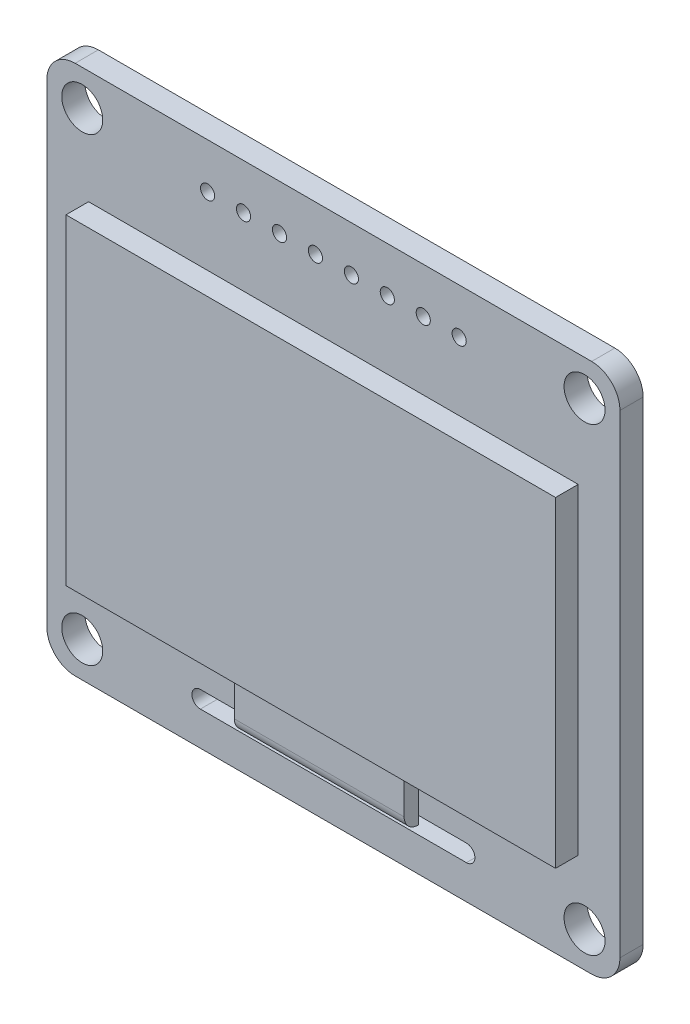
ISO-10303-21;
HEADER;
FILE_DESCRIPTION(('STEP AP214'),'2;1');
FILE_NAME('part.step','',(''),(''),'','','');
FILE_SCHEMA(('AUTOMOTIVE_DESIGN { 1 0 10303 214 1 1 1 1 }'));
ENDSEC;
DATA;
#1=APPLICATION_CONTEXT('core data for automotive mechanical design processes');
#2=APPLICATION_PROTOCOL_DEFINITION('international standard','automotive_design',2000,#1);
#3=PRODUCT_CONTEXT('',#1,'mechanical');
#4=PRODUCT('Part','Part','',(#3));
#5=PRODUCT_RELATED_PRODUCT_CATEGORY('part','',(#4));
#6=PRODUCT_DEFINITION_FORMATION('','',#4);
#7=PRODUCT_DEFINITION_CONTEXT('part definition',#1,'design');
#8=PRODUCT_DEFINITION('design','',#6,#7);
#9=PRODUCT_DEFINITION_SHAPE('','',#8);
#10=(LENGTH_UNIT() NAMED_UNIT(*) SI_UNIT(.MILLI.,.METRE.));
#11=(NAMED_UNIT(*) PLANE_ANGLE_UNIT() SI_UNIT($,.RADIAN.));
#12=(NAMED_UNIT(*) SI_UNIT($,.STERADIAN.) SOLID_ANGLE_UNIT());
#13=UNCERTAINTY_MEASURE_WITH_UNIT(LENGTH_MEASURE(1.E-05),#10,'distance_accuracy_value','');
#14=(GEOMETRIC_REPRESENTATION_CONTEXT(3) GLOBAL_UNCERTAINTY_ASSIGNED_CONTEXT((#13)) GLOBAL_UNIT_ASSIGNED_CONTEXT((#10,
#11,#12)) REPRESENTATION_CONTEXT('',''));
#15=CARTESIAN_POINT('',(0.,0.,0.));
#16=DIRECTION('',(0.,0.,1.));
#17=DIRECTION('',(1.,0.,0.));
#18=AXIS2_PLACEMENT_3D('',#15,#16,#17);
#19=CARTESIAN_POINT('',(0.,0.,1.64));
#20=DIRECTION('',(0.,0.,1.));
#21=DIRECTION('',(1.,0.,0.));
#22=AXIS2_PLACEMENT_3D('',#19,#20,#21);
#23=PLANE('',#22);
#24=CARTESIAN_POINT('',(-6.35,15.55,1.64));
#25=DIRECTION('',(0.,0.,1.));
#26=DIRECTION('',(1.,0.,0.));
#27=AXIS2_PLACEMENT_3D('',#24,#25,#26);
#28=CIRCLE('',#27,0.500000000000001);
#29=CARTESIAN_POINT('',(-5.85,15.55,1.64));
#30=VERTEX_POINT('',#29);
#31=EDGE_CURVE('E233',#30,#30,#28,.T.);
#32=ORIENTED_EDGE('',*,*,#31,.F.);
#33=EDGE_LOOP('',(#32));
#34=FACE_BOUND('',#33,.T.);
#35=CARTESIAN_POINT('',(-3.81,15.55,1.64));
#36=DIRECTION('',(0.,0.,1.));
#37=DIRECTION('',(1.,0.,0.));
#38=AXIS2_PLACEMENT_3D('',#35,#36,#37);
#39=CIRCLE('',#38,0.5);
#40=CARTESIAN_POINT('',(-3.31,15.55,1.64));
#41=VERTEX_POINT('',#40);
#42=EDGE_CURVE('E241',#41,#41,#39,.T.);
#43=ORIENTED_EDGE('',*,*,#42,.F.);
#44=EDGE_LOOP('',(#43));
#45=FACE_BOUND('',#44,.T.);
#46=CARTESIAN_POINT('',(-1.27,15.55,1.64));
#47=DIRECTION('',(0.,0.,1.));
#48=DIRECTION('',(1.,0.,0.));
#49=AXIS2_PLACEMENT_3D('',#46,#47,#48);
#50=CIRCLE('',#49,0.5);
#51=CARTESIAN_POINT('',(-0.77,15.55,1.64));
#52=VERTEX_POINT('',#51);
#53=EDGE_CURVE('E247',#52,#52,#50,.T.);
#54=ORIENTED_EDGE('',*,*,#53,.F.);
#55=EDGE_LOOP('',(#54));
#56=FACE_BOUND('',#55,.T.);
#57=CARTESIAN_POINT('',(1.27,15.55,1.64));
#58=DIRECTION('',(0.,0.,1.));
#59=DIRECTION('',(1.,0.,0.));
#60=AXIS2_PLACEMENT_3D('',#57,#58,#59);
#61=CIRCLE('',#60,0.500000000000001);
#62=CARTESIAN_POINT('',(1.77,15.55,1.64));
#63=VERTEX_POINT('',#62);
#64=EDGE_CURVE('E253',#63,#63,#61,.T.);
#65=ORIENTED_EDGE('',*,*,#64,.F.);
#66=EDGE_LOOP('',(#65));
#67=FACE_BOUND('',#66,.T.);
#68=CARTESIAN_POINT('',(3.81,15.55,1.64));
#69=DIRECTION('',(0.,0.,1.));
#70=DIRECTION('',(1.,0.,0.));
#71=AXIS2_PLACEMENT_3D('',#68,#69,#70);
#72=CIRCLE('',#71,0.500000000000001);
#73=CARTESIAN_POINT('',(4.31,15.55,1.64));
#74=VERTEX_POINT('',#73);
#75=EDGE_CURVE('E259',#74,#74,#72,.T.);
#76=ORIENTED_EDGE('',*,*,#75,.F.);
#77=EDGE_LOOP('',(#76));
#78=FACE_BOUND('',#77,.T.);
#79=CARTESIAN_POINT('',(6.35,15.55,1.64));
#80=DIRECTION('',(0.,0.,1.));
#81=DIRECTION('',(1.,0.,0.));
#82=AXIS2_PLACEMENT_3D('',#79,#80,#81);
#83=CIRCLE('',#82,0.500000000000001);
#84=CARTESIAN_POINT('',(6.85,15.55,1.64));
#85=VERTEX_POINT('',#84);
#86=EDGE_CURVE('E265',#85,#85,#83,.T.);
#87=ORIENTED_EDGE('',*,*,#86,.F.);
#88=EDGE_LOOP('',(#87));
#89=FACE_BOUND('',#88,.T.);
#90=CARTESIAN_POINT('',(8.89,15.55,1.64));
#91=DIRECTION('',(0.,0.,1.));
#92=DIRECTION('',(1.,0.,0.));
#93=AXIS2_PLACEMENT_3D('',#90,#91,#92);
#94=CIRCLE('',#93,0.499999999999999);
#95=CARTESIAN_POINT('',(9.39,15.55,1.64));
#96=VERTEX_POINT('',#95);
#97=EDGE_CURVE('E232',#96,#96,#94,.T.);
#98=ORIENTED_EDGE('',*,*,#97,.F.);
#99=EDGE_LOOP('',(#98));
#100=FACE_BOUND('',#99,.T.);
#101=CARTESIAN_POINT('',(-8.89,15.55,1.64));
#102=DIRECTION('',(0.,0.,1.));
#103=DIRECTION('',(1.,0.,0.));
#104=AXIS2_PLACEMENT_3D('',#101,#102,#103);
#105=CIRCLE('',#104,0.500000000000001);
#106=CARTESIAN_POINT('',(-8.39,15.55,1.64));
#107=VERTEX_POINT('',#106);
#108=EDGE_CURVE('E240',#107,#107,#105,.T.);
#109=ORIENTED_EDGE('',*,*,#108,.F.);
#110=EDGE_LOOP('',(#109));
#111=FACE_BOUND('',#110,.T.);
#112=CARTESIAN_POINT('',(17.75,16.25,1.64));
#113=DIRECTION('',(0.,0.,1.));
#114=DIRECTION('',(1.,0.,0.));
#115=AXIS2_PLACEMENT_3D('',#112,#113,#114);
#116=CIRCLE('',#115,1.45);
#117=CARTESIAN_POINT('',(19.2,16.25,1.64));
#118=VERTEX_POINT('',#117);
#119=EDGE_CURVE('E314',#118,#118,#116,.T.);
#120=ORIENTED_EDGE('',*,*,#119,.F.);
#121=EDGE_LOOP('',(#120));
#122=FACE_BOUND('',#121,.T.);
#123=CARTESIAN_POINT('',(17.7500000000003,-16.25,1.64));
#124=DIRECTION('',(0.,0.,1.));
#125=DIRECTION('',(1.,0.,0.));
#126=AXIS2_PLACEMENT_3D('',#123,#124,#125);
#127=CIRCLE('',#126,1.45);
#128=CARTESIAN_POINT('',(19.2000000000003,-16.25,1.64));
#129=VERTEX_POINT('',#128);
#130=EDGE_CURVE('E322',#129,#129,#127,.T.);
#131=ORIENTED_EDGE('',*,*,#130,.F.);
#132=EDGE_LOOP('',(#131));
#133=FACE_BOUND('',#132,.T.);
#134=CARTESIAN_POINT('',(-17.7499999999997,-16.25,1.64));
#135=DIRECTION('',(0.,0.,1.));
#136=DIRECTION('',(1.,0.,0.));
#137=AXIS2_PLACEMENT_3D('',#134,#135,#136);
#138=CIRCLE('',#137,1.45);
#139=CARTESIAN_POINT('',(-16.2999999999997,-16.25,1.64));
#140=VERTEX_POINT('',#139);
#141=EDGE_CURVE('E313',#140,#140,#138,.T.);
#142=ORIENTED_EDGE('',*,*,#141,.F.);
#143=EDGE_LOOP('',(#142));
#144=FACE_BOUND('',#143,.T.);
#145=CARTESIAN_POINT('',(-17.75,16.25,1.64));
#146=DIRECTION('',(0.,0.,1.));
#147=DIRECTION('',(1.,0.,0.));
#148=AXIS2_PLACEMENT_3D('',#145,#146,#147);
#149=CIRCLE('',#148,1.45);
#150=CARTESIAN_POINT('',(-16.3,16.25,1.64));
#151=VERTEX_POINT('',#150);
#152=EDGE_CURVE('E321',#151,#151,#149,.T.);
#153=ORIENTED_EDGE('',*,*,#152,.F.);
#154=EDGE_LOOP('',(#153));
#155=FACE_BOUND('',#154,.T.);
#156=DIRECTION('',(0.,-1.,0.));
#157=VECTOR('',#156,1.);
#158=CARTESIAN_POINT('',(-20.25,18.75,1.64));
#159=LINE('',#158,#157);
#160=CARTESIAN_POINT('',(-20.25,16.75,1.64));
#161=VERTEX_POINT('',#160);
#162=CARTESIAN_POINT('',(-20.25,-16.75,1.64));
#163=VERTEX_POINT('',#162);
#164=EDGE_CURVE('E338',#161,#163,#159,.T.);
#165=ORIENTED_EDGE('',*,*,#164,.T.);
#166=CARTESIAN_POINT('',(-18.25,-16.75,1.64));
#167=DIRECTION('',(0.,0.,1.));
#168=DIRECTION('',(1.,0.,0.));
#169=AXIS2_PLACEMENT_3D('',#166,#167,#168);
#170=CIRCLE('',#169,2.);
#171=CARTESIAN_POINT('',(-18.25,-18.75,1.64));
#172=VERTEX_POINT('',#171);
#173=EDGE_CURVE('E385',#163,#172,#170,.T.);
#174=ORIENTED_EDGE('',*,*,#173,.T.);
#175=DIRECTION('',(1.,0.,0.));
#176=VECTOR('',#175,1.);
#177=CARTESIAN_POINT('',(-20.25,-18.75,1.64));
#178=LINE('',#177,#176);
#179=CARTESIAN_POINT('',(18.25,-18.75,1.64));
#180=VERTEX_POINT('',#179);
#181=EDGE_CURVE('E341',#172,#180,#178,.T.);
#182=ORIENTED_EDGE('',*,*,#181,.T.);
#183=CARTESIAN_POINT('',(18.25,-16.75,1.64));
#184=DIRECTION('',(0.,0.,1.));
#185=DIRECTION('',(1.,0.,0.));
#186=AXIS2_PLACEMENT_3D('',#183,#184,#185);
#187=CIRCLE('',#186,2.);
#188=CARTESIAN_POINT('',(20.25,-16.75,1.64));
#189=VERTEX_POINT('',#188);
#190=EDGE_CURVE('E383',#180,#189,#187,.T.);
#191=ORIENTED_EDGE('',*,*,#190,.T.);
#192=DIRECTION('',(0.,1.,0.));
#193=VECTOR('',#192,1.);
#194=CARTESIAN_POINT('',(20.25,18.75,1.64));
#195=LINE('',#194,#193);
#196=CARTESIAN_POINT('',(20.25,16.75,1.64));
#197=VERTEX_POINT('',#196);
#198=EDGE_CURVE('E345',#189,#197,#195,.T.);
#199=ORIENTED_EDGE('',*,*,#198,.T.);
#200=CARTESIAN_POINT('',(18.25,16.75,1.64));
#201=DIRECTION('',(0.,0.,1.));
#202=DIRECTION('',(1.,0.,0.));
#203=AXIS2_PLACEMENT_3D('',#200,#201,#202);
#204=CIRCLE('',#203,2.);
#205=CARTESIAN_POINT('',(18.25,18.75,1.64));
#206=VERTEX_POINT('',#205);
#207=EDGE_CURVE('E381',#197,#206,#204,.T.);
#208=ORIENTED_EDGE('',*,*,#207,.T.);
#209=DIRECTION('',(-1.,0.,0.));
#210=VECTOR('',#209,1.);
#211=CARTESIAN_POINT('',(-20.25,18.75,1.64));
#212=LINE('',#211,#210);
#213=CARTESIAN_POINT('',(-18.25,18.75,1.64));
#214=VERTEX_POINT('',#213);
#215=EDGE_CURVE('E348',#206,#214,#212,.T.);
#216=ORIENTED_EDGE('',*,*,#215,.T.);
#217=CARTESIAN_POINT('',(-18.25,16.75,1.64));
#218=DIRECTION('',(0.,0.,1.));
#219=DIRECTION('',(1.,0.,0.));
#220=AXIS2_PLACEMENT_3D('',#217,#218,#219);
#221=CIRCLE('',#220,2.);
#222=EDGE_CURVE('E379',#214,#161,#221,.T.);
#223=ORIENTED_EDGE('',*,*,#222,.T.);
#224=EDGE_LOOP('',(#165,#174,#182,#191,#199,#208,#216,#223));
#225=FACE_BOUND('',#224,.T.);
#226=DIRECTION('',(-1.,0.,0.));
#227=VECTOR('',#226,1.);
#228=CARTESIAN_POINT('',(-9.4,-15.15,1.64));
#229=LINE('',#228,#227);
#230=CARTESIAN_POINT('',(-6.,-15.15,1.64));
#231=VERTEX_POINT('',#230);
#232=CARTESIAN_POINT('',(-9.4,-15.15,1.64));
#233=VERTEX_POINT('',#232);
#234=EDGE_CURVE('E296',#231,#233,#229,.T.);
#235=ORIENTED_EDGE('',*,*,#234,.F.);
#236=DIRECTION('',(0.,-1.,0.));
#237=VECTOR('',#236,1.);
#238=CARTESIAN_POINT('',(-6.,-11.95,1.64));
#239=LINE('',#238,#237);
#240=CARTESIAN_POINT('',(-6.,-11.95,1.64));
#241=VERTEX_POINT('',#240);
#242=EDGE_CURVE('E409',#241,#231,#239,.T.);
#243=ORIENTED_EDGE('',*,*,#242,.F.);
#244=DIRECTION('',(1.,0.,0.));
#245=VECTOR('',#244,1.);
#246=CARTESIAN_POINT('',(-17.3,-11.95,1.64));
#247=LINE('',#246,#245);
#248=CARTESIAN_POINT('',(-17.3,-11.95,1.64));
#249=VERTEX_POINT('',#248);
#250=EDGE_CURVE('E194',#249,#241,#247,.T.);
#251=ORIENTED_EDGE('',*,*,#250,.F.);
#252=DIRECTION('',(0.,-1.,0.));
#253=VECTOR('',#252,1.);
#254=CARTESIAN_POINT('',(-17.3,10.75,1.64));
#255=LINE('',#254,#253);
#256=CARTESIAN_POINT('',(-17.3,10.75,1.64));
#257=VERTEX_POINT('',#256);
#258=EDGE_CURVE('E203',#257,#249,#255,.T.);
#259=ORIENTED_EDGE('',*,*,#258,.F.);
#260=DIRECTION('',(-1.,0.,0.));
#261=VECTOR('',#260,1.);
#262=CARTESIAN_POINT('',(-17.3,10.75,1.64));
#263=LINE('',#262,#261);
#264=CARTESIAN_POINT('',(17.3,10.75,1.64));
#265=VERTEX_POINT('',#264);
#266=EDGE_CURVE('E208',#265,#257,#263,.T.);
#267=ORIENTED_EDGE('',*,*,#266,.F.);
#268=DIRECTION('',(0.,1.,0.));
#269=VECTOR('',#268,1.);
#270=CARTESIAN_POINT('',(17.3,10.75,1.64));
#271=LINE('',#270,#269);
#272=CARTESIAN_POINT('',(17.3,-11.95,1.64));
#273=VERTEX_POINT('',#272);
#274=EDGE_CURVE('E219',#273,#265,#271,.T.);
#275=ORIENTED_EDGE('',*,*,#274,.F.);
#276=CARTESIAN_POINT('',(6.,-11.95,1.64));
#277=VERTEX_POINT('',#276);
#278=EDGE_CURVE('E217',#277,#273,#247,.T.);
#279=ORIENTED_EDGE('',*,*,#278,.F.);
#280=DIRECTION('',(0.,1.,0.));
#281=VECTOR('',#280,1.);
#282=CARTESIAN_POINT('',(6.,-11.95,1.64));
#283=LINE('',#282,#281);
#284=CARTESIAN_POINT('',(6.,-15.15,1.64));
#285=VERTEX_POINT('',#284);
#286=EDGE_CURVE('E408',#285,#277,#283,.T.);
#287=ORIENTED_EDGE('',*,*,#286,.F.);
#288=CARTESIAN_POINT('',(9.4,-15.15,1.64));
#289=VERTEX_POINT('',#288);
#290=EDGE_CURVE('E297',#289,#285,#229,.T.);
#291=ORIENTED_EDGE('',*,*,#290,.F.);
#292=CARTESIAN_POINT('',(9.4,-15.75,1.64));
#293=DIRECTION('',(0.,0.,1.));
#294=DIRECTION('',(1.,0.,0.));
#295=AXIS2_PLACEMENT_3D('',#292,#293,#294);
#296=CIRCLE('',#295,0.599999999999999);
#297=CARTESIAN_POINT('',(9.4,-16.35,1.64));
#298=VERTEX_POINT('',#297);
#299=EDGE_CURVE('E293',#298,#289,#296,.T.);
#300=ORIENTED_EDGE('',*,*,#299,.F.);
#301=DIRECTION('',(1.,0.,0.));
#302=VECTOR('',#301,1.);
#303=CARTESIAN_POINT('',(-9.4,-16.35,1.64));
#304=LINE('',#303,#302);
#305=CARTESIAN_POINT('',(-9.4,-16.35,1.64));
#306=VERTEX_POINT('',#305);
#307=EDGE_CURVE('E290',#306,#298,#304,.T.);
#308=ORIENTED_EDGE('',*,*,#307,.F.);
#309=CARTESIAN_POINT('',(-9.4,-15.75,1.64));
#310=DIRECTION('',(0.,0.,1.));
#311=DIRECTION('',(1.,0.,0.));
#312=AXIS2_PLACEMENT_3D('',#309,#310,#311);
#313=CIRCLE('',#312,0.6);
#314=EDGE_CURVE('E288',#233,#306,#313,.T.);
#315=ORIENTED_EDGE('',*,*,#314,.F.);
#316=EDGE_LOOP('',(#235,#243,#251,#259,#267,#275,#279,#287,#291,#300,#308,#315));
#317=FACE_BOUND('',#316,.T.);
#318=ADVANCED_FACE('F34',(#34,#45,#56,#67,#78,#89,#100,#111,#122,#133,#144,#155,#225,#317),#23,.T.);
#319=CARTESIAN_POINT('',(-17.3,-11.95,3.24));
#320=DIRECTION('',(0.,1.,0.));
#321=DIRECTION('',(0.,0.,1.));
#322=AXIS2_PLACEMENT_3D('',#319,#320,#321);
#323=PLANE('',#322);
#324=DIRECTION('',(0.,0.,-1.));
#325=VECTOR('',#324,1.);
#326=CARTESIAN_POINT('',(-6.,-11.95,2.64));
#327=LINE('',#326,#325);
#328=CARTESIAN_POINT('',(-6.,-11.95,2.64));
#329=VERTEX_POINT('',#328);
#330=EDGE_CURVE('E184',#329,#241,#327,.T.);
#331=ORIENTED_EDGE('',*,*,#330,.F.);
#332=DIRECTION('',(-1.,0.,0.));
#333=VECTOR('',#332,1.);
#334=CARTESIAN_POINT('',(-6.,-11.95,2.64));
#335=LINE('',#334,#333);
#336=CARTESIAN_POINT('',(6.,-11.95,2.64));
#337=VERTEX_POINT('',#336);
#338=EDGE_CURVE('E175',#337,#329,#335,.T.);
#339=ORIENTED_EDGE('',*,*,#338,.F.);
#340=DIRECTION('',(0.,0.,-1.));
#341=VECTOR('',#340,1.);
#342=CARTESIAN_POINT('',(6.,-11.95,2.64));
#343=LINE('',#342,#341);
#344=EDGE_CURVE('E195',#337,#277,#343,.T.);
#345=ORIENTED_EDGE('',*,*,#344,.T.);
#346=ORIENTED_EDGE('',*,*,#278,.T.);
#347=DIRECTION('',(0.,0.,-1.));
#348=VECTOR('',#347,1.);
#349=CARTESIAN_POINT('',(17.3,-11.95,3.24));
#350=LINE('',#349,#348);
#351=CARTESIAN_POINT('',(17.3,-11.95,3.24));
#352=VERTEX_POINT('',#351);
#353=EDGE_CURVE('E227',#352,#273,#350,.T.);
#354=ORIENTED_EDGE('',*,*,#353,.F.);
#355=DIRECTION('',(1.,0.,0.));
#356=VECTOR('',#355,1.);
#357=CARTESIAN_POINT('',(-17.3,-11.95,3.24));
#358=LINE('',#357,#356);
#359=CARTESIAN_POINT('',(-17.3,-11.95,3.24));
#360=VERTEX_POINT('',#359);
#361=EDGE_CURVE('E207',#360,#352,#358,.T.);
#362=ORIENTED_EDGE('',*,*,#361,.F.);
#363=DIRECTION('',(0.,0.,-1.));
#364=VECTOR('',#363,1.);
#365=CARTESIAN_POINT('',(-17.3,-11.95,3.24));
#366=LINE('',#365,#364);
#367=EDGE_CURVE('E230',#360,#249,#366,.T.);
#368=ORIENTED_EDGE('',*,*,#367,.T.);
#369=ORIENTED_EDGE('',*,*,#250,.T.);
#370=EDGE_LOOP('',(#331,#339,#345,#346,#354,#362,#368,#369));
#371=FACE_BOUND('',#370,.T.);
#372=ADVANCED_FACE('F192',(#371),#323,.F.);
#373=CARTESIAN_POINT('',(-20.25,18.75,1.64));
#374=DIRECTION('',(1.,0.,0.));
#375=DIRECTION('',(0.,1.,0.));
#376=AXIS2_PLACEMENT_3D('',#373,#374,#375);
#377=PLANE('',#376);
#378=DIRECTION('',(0.,-1.,0.));
#379=VECTOR('',#378,1.);
#380=CARTESIAN_POINT('',(-20.25,18.75,0.));
#381=LINE('',#380,#379);
#382=CARTESIAN_POINT('',(-20.25,16.75,0.));
#383=VERTEX_POINT('',#382);
#384=CARTESIAN_POINT('',(-20.25,-16.75,0.));
#385=VERTEX_POINT('',#384);
#386=EDGE_CURVE('E337',#383,#385,#381,.T.);
#387=ORIENTED_EDGE('',*,*,#386,.T.);
#388=DIRECTION('',(0.,0.,-1.));
#389=VECTOR('',#388,1.);
#390=CARTESIAN_POINT('',(-20.25,-16.75,1.64));
#391=LINE('',#390,#389);
#392=EDGE_CURVE('E377',#385,#163,#391,.F.);
#393=ORIENTED_EDGE('',*,*,#392,.T.);
#394=ORIENTED_EDGE('',*,*,#164,.F.);
#395=DIRECTION('',(0.,0.,-1.));
#396=VECTOR('',#395,1.);
#397=CARTESIAN_POINT('',(-20.25,16.75,1.64));
#398=LINE('',#397,#396);
#399=EDGE_CURVE('E374',#161,#383,#398,.T.);
#400=ORIENTED_EDGE('',*,*,#399,.T.);
#401=EDGE_LOOP('',(#387,#393,#394,#400));
#402=FACE_BOUND('',#401,.T.);
#403=ADVANCED_FACE('F455',(#402),#377,.F.);
#404=CARTESIAN_POINT('',(-20.25,-18.75,1.64));
#405=DIRECTION('',(0.,1.,0.));
#406=DIRECTION('',(0.,0.,1.));
#407=AXIS2_PLACEMENT_3D('',#404,#405,#406);
#408=PLANE('',#407);
#409=ORIENTED_EDGE('',*,*,#181,.F.);
#410=DIRECTION('',(0.,0.,-1.));
#411=VECTOR('',#410,1.);
#412=CARTESIAN_POINT('',(-18.25,-18.75,1.64));
#413=LINE('',#412,#411);
#414=CARTESIAN_POINT('',(-18.25,-18.75,0.));
#415=VERTEX_POINT('',#414);
#416=EDGE_CURVE('E363',#172,#415,#413,.T.);
#417=ORIENTED_EDGE('',*,*,#416,.T.);
#418=DIRECTION('',(1.,0.,0.));
#419=VECTOR('',#418,1.);
#420=CARTESIAN_POINT('',(-20.25,-18.75,0.));
#421=LINE('',#420,#419);
#422=CARTESIAN_POINT('',(18.25,-18.75,0.));
#423=VERTEX_POINT('',#422);
#424=EDGE_CURVE('E354',#415,#423,#421,.T.);
#425=ORIENTED_EDGE('',*,*,#424,.T.);
#426=DIRECTION('',(0.,0.,-1.));
#427=VECTOR('',#426,1.);
#428=CARTESIAN_POINT('',(18.25,-18.75,1.64));
#429=LINE('',#428,#427);
#430=EDGE_CURVE('E351',#423,#180,#429,.F.);
#431=ORIENTED_EDGE('',*,*,#430,.T.);
#432=EDGE_LOOP('',(#409,#417,#425,#431));
#433=FACE_BOUND('',#432,.T.);
#434=ADVANCED_FACE('F475',(#433),#408,.F.);
#435=CARTESIAN_POINT('',(20.25,18.75,1.64));
#436=DIRECTION('',(-1.,0.,0.));
#437=DIRECTION('',(0.,-1.,0.));
#438=AXIS2_PLACEMENT_3D('',#435,#436,#437);
#439=PLANE('',#438);
#440=ORIENTED_EDGE('',*,*,#198,.F.);
#441=DIRECTION('',(0.,0.,-1.));
#442=VECTOR('',#441,1.);
#443=CARTESIAN_POINT('',(20.25,-16.75,1.64));
#444=LINE('',#443,#442);
#445=CARTESIAN_POINT('',(20.25,-16.75,0.));
#446=VERTEX_POINT('',#445);
#447=EDGE_CURVE('E389',#189,#446,#444,.T.);
#448=ORIENTED_EDGE('',*,*,#447,.T.);
#449=DIRECTION('',(0.,1.,0.));
#450=VECTOR('',#449,1.);
#451=CARTESIAN_POINT('',(20.25,18.75,0.));
#452=LINE('',#451,#450);
#453=CARTESIAN_POINT('',(20.25,16.75,0.));
#454=VERTEX_POINT('',#453);
#455=EDGE_CURVE('E357',#446,#454,#452,.T.);
#456=ORIENTED_EDGE('',*,*,#455,.T.);
#457=DIRECTION('',(0.,0.,-1.));
#458=VECTOR('',#457,1.);
#459=CARTESIAN_POINT('',(20.25,16.75,1.64));
#460=LINE('',#459,#458);
#461=EDGE_CURVE('E387',#454,#197,#460,.F.);
#462=ORIENTED_EDGE('',*,*,#461,.T.);
#463=EDGE_LOOP('',(#440,#448,#456,#462));
#464=FACE_BOUND('',#463,.T.);
#465=ADVANCED_FACE('F471',(#464),#439,.F.);
#466=CARTESIAN_POINT('',(-20.25,18.75,1.64));
#467=DIRECTION('',(0.,-1.,0.));
#468=DIRECTION('',(0.,0.,-1.));
#469=AXIS2_PLACEMENT_3D('',#466,#467,#468);
#470=PLANE('',#469);
#471=ORIENTED_EDGE('',*,*,#215,.F.);
#472=DIRECTION('',(0.,0.,-1.));
#473=VECTOR('',#472,1.);
#474=CARTESIAN_POINT('',(18.25,18.75,1.64));
#475=LINE('',#474,#473);
#476=CARTESIAN_POINT('',(18.25,18.75,0.));
#477=VERTEX_POINT('',#476);
#478=EDGE_CURVE('E394',#206,#477,#475,.T.);
#479=ORIENTED_EDGE('',*,*,#478,.T.);
#480=DIRECTION('',(-1.,0.,0.));
#481=VECTOR('',#480,1.);
#482=CARTESIAN_POINT('',(-20.25,18.75,0.));
#483=LINE('',#482,#481);
#484=CARTESIAN_POINT('',(-18.25,18.75,0.));
#485=VERTEX_POINT('',#484);
#486=EDGE_CURVE('E342',#477,#485,#483,.T.);
#487=ORIENTED_EDGE('',*,*,#486,.T.);
#488=DIRECTION('',(0.,0.,-1.));
#489=VECTOR('',#488,1.);
#490=CARTESIAN_POINT('',(-18.25,18.75,1.64));
#491=LINE('',#490,#489);
#492=EDGE_CURVE('E392',#485,#214,#491,.F.);
#493=ORIENTED_EDGE('',*,*,#492,.T.);
#494=EDGE_LOOP('',(#471,#479,#487,#493));
#495=FACE_BOUND('',#494,.T.);
#496=ADVANCED_FACE('F467',(#495),#470,.F.);
#497=CARTESIAN_POINT('',(0.,0.,0.));
#498=DIRECTION('',(0.,0.,1.));
#499=DIRECTION('',(1.,0.,0.));
#500=AXIS2_PLACEMENT_3D('',#497,#498,#499);
#501=PLANE('',#500);
#502=CARTESIAN_POINT('',(-6.35,15.55,0.));
#503=DIRECTION('',(0.,0.,1.));
#504=DIRECTION('',(1.,0.,0.));
#505=AXIS2_PLACEMENT_3D('',#502,#503,#504);
#506=CIRCLE('',#505,0.500000000000001);
#507=CARTESIAN_POINT('',(-5.85,15.55,0.));
#508=VERTEX_POINT('',#507);
#509=EDGE_CURVE('E236',#508,#508,#506,.F.);
#510=ORIENTED_EDGE('',*,*,#509,.F.);
#511=EDGE_LOOP('',(#510));
#512=FACE_BOUND('',#511,.T.);
#513=CARTESIAN_POINT('',(-3.81,15.55,0.));
#514=DIRECTION('',(0.,0.,1.));
#515=DIRECTION('',(1.,0.,0.));
#516=AXIS2_PLACEMENT_3D('',#513,#514,#515);
#517=CIRCLE('',#516,0.5);
#518=CARTESIAN_POINT('',(-3.31,15.55,0.));
#519=VERTEX_POINT('',#518);
#520=EDGE_CURVE('E237',#519,#519,#517,.F.);
#521=ORIENTED_EDGE('',*,*,#520,.F.);
#522=EDGE_LOOP('',(#521));
#523=FACE_BOUND('',#522,.T.);
#524=CARTESIAN_POINT('',(-1.27,15.55,0.));
#525=DIRECTION('',(0.,0.,1.));
#526=DIRECTION('',(1.,0.,0.));
#527=AXIS2_PLACEMENT_3D('',#524,#525,#526);
#528=CIRCLE('',#527,0.5);
#529=CARTESIAN_POINT('',(-0.77,15.55,0.));
#530=VERTEX_POINT('',#529);
#531=EDGE_CURVE('E244',#530,#530,#528,.F.);
#532=ORIENTED_EDGE('',*,*,#531,.F.);
#533=EDGE_LOOP('',(#532));
#534=FACE_BOUND('',#533,.T.);
#535=CARTESIAN_POINT('',(1.27,15.55,0.));
#536=DIRECTION('',(0.,0.,1.));
#537=DIRECTION('',(1.,0.,0.));
#538=AXIS2_PLACEMENT_3D('',#535,#536,#537);
#539=CIRCLE('',#538,0.500000000000001);
#540=CARTESIAN_POINT('',(1.77,15.55,0.));
#541=VERTEX_POINT('',#540);
#542=EDGE_CURVE('E250',#541,#541,#539,.F.);
#543=ORIENTED_EDGE('',*,*,#542,.F.);
#544=EDGE_LOOP('',(#543));
#545=FACE_BOUND('',#544,.T.);
#546=CARTESIAN_POINT('',(3.81,15.55,0.));
#547=DIRECTION('',(0.,0.,1.));
#548=DIRECTION('',(1.,0.,0.));
#549=AXIS2_PLACEMENT_3D('',#546,#547,#548);
#550=CIRCLE('',#549,0.500000000000001);
#551=CARTESIAN_POINT('',(4.31,15.55,0.));
#552=VERTEX_POINT('',#551);
#553=EDGE_CURVE('E256',#552,#552,#550,.F.);
#554=ORIENTED_EDGE('',*,*,#553,.F.);
#555=EDGE_LOOP('',(#554));
#556=FACE_BOUND('',#555,.T.);
#557=CARTESIAN_POINT('',(6.35,15.55,0.));
#558=DIRECTION('',(0.,0.,1.));
#559=DIRECTION('',(1.,0.,0.));
#560=AXIS2_PLACEMENT_3D('',#557,#558,#559);
#561=CIRCLE('',#560,0.500000000000001);
#562=CARTESIAN_POINT('',(6.85,15.55,0.));
#563=VERTEX_POINT('',#562);
#564=EDGE_CURVE('E262',#563,#563,#561,.F.);
#565=ORIENTED_EDGE('',*,*,#564,.F.);
#566=EDGE_LOOP('',(#565));
#567=FACE_BOUND('',#566,.T.);
#568=CARTESIAN_POINT('',(8.89,15.55,0.));
#569=DIRECTION('',(0.,0.,1.));
#570=DIRECTION('',(1.,0.,0.));
#571=AXIS2_PLACEMENT_3D('',#568,#569,#570);
#572=CIRCLE('',#571,0.499999999999999);
#573=CARTESIAN_POINT('',(9.39,15.55,0.));
#574=VERTEX_POINT('',#573);
#575=EDGE_CURVE('E268',#574,#574,#572,.F.);
#576=ORIENTED_EDGE('',*,*,#575,.F.);
#577=EDGE_LOOP('',(#576));
#578=FACE_BOUND('',#577,.T.);
#579=CARTESIAN_POINT('',(-8.89,15.55,0.));
#580=DIRECTION('',(0.,0.,1.));
#581=DIRECTION('',(1.,0.,0.));
#582=AXIS2_PLACEMENT_3D('',#579,#580,#581);
#583=CIRCLE('',#582,0.500000000000001);
#584=CARTESIAN_POINT('',(-8.39,15.55,0.));
#585=VERTEX_POINT('',#584);
#586=EDGE_CURVE('E277',#585,#585,#583,.F.);
#587=ORIENTED_EDGE('',*,*,#586,.F.);
#588=EDGE_LOOP('',(#587));
#589=FACE_BOUND('',#588,.T.);
#590=DIRECTION('',(1.,0.,0.));
#591=VECTOR('',#590,1.);
#592=CARTESIAN_POINT('',(-9.4,-15.15,0.));
#593=LINE('',#592,#591);
#594=CARTESIAN_POINT('',(-9.4,-15.15,0.));
#595=VERTEX_POINT('',#594);
#596=CARTESIAN_POINT('',(9.4,-15.15,0.));
#597=VERTEX_POINT('',#596);
#598=EDGE_CURVE('E282',#595,#597,#593,.T.);
#599=ORIENTED_EDGE('',*,*,#598,.F.);
#600=CARTESIAN_POINT('',(-9.4,-15.75,0.));
#601=DIRECTION('',(0.,0.,1.));
#602=DIRECTION('',(1.,0.,0.));
#603=AXIS2_PLACEMENT_3D('',#600,#601,#602);
#604=CIRCLE('',#603,0.6);
#605=CARTESIAN_POINT('',(-9.4,-16.35,0.));
#606=VERTEX_POINT('',#605);
#607=EDGE_CURVE('E285',#606,#595,#604,.F.);
#608=ORIENTED_EDGE('',*,*,#607,.F.);
#609=DIRECTION('',(-1.,0.,0.));
#610=VECTOR('',#609,1.);
#611=CARTESIAN_POINT('',(-9.4,-16.35,0.));
#612=LINE('',#611,#610);
#613=CARTESIAN_POINT('',(9.4,-16.35,0.));
#614=VERTEX_POINT('',#613);
#615=EDGE_CURVE('E304',#614,#606,#612,.T.);
#616=ORIENTED_EDGE('',*,*,#615,.F.);
#617=CARTESIAN_POINT('',(9.4,-15.75,0.));
#618=DIRECTION('',(0.,0.,1.));
#619=DIRECTION('',(1.,0.,0.));
#620=AXIS2_PLACEMENT_3D('',#617,#618,#619);
#621=CIRCLE('',#620,0.599999999999999);
#622=EDGE_CURVE('E280',#597,#614,#621,.F.);
#623=ORIENTED_EDGE('',*,*,#622,.F.);
#624=EDGE_LOOP('',(#599,#608,#616,#623));
#625=FACE_BOUND('',#624,.T.);
#626=CARTESIAN_POINT('',(17.75,16.25,0.));
#627=DIRECTION('',(0.,0.,1.));
#628=DIRECTION('',(1.,0.,0.));
#629=AXIS2_PLACEMENT_3D('',#626,#627,#628);
#630=CIRCLE('',#629,1.45);
#631=CARTESIAN_POINT('',(19.2,16.25,0.));
#632=VERTEX_POINT('',#631);
#633=EDGE_CURVE('E317',#632,#632,#630,.F.);
#634=ORIENTED_EDGE('',*,*,#633,.F.);
#635=EDGE_LOOP('',(#634));
#636=FACE_BOUND('',#635,.T.);
#637=CARTESIAN_POINT('',(17.7500000000003,-16.25,0.));
#638=DIRECTION('',(0.,0.,1.));
#639=DIRECTION('',(1.,0.,0.));
#640=AXIS2_PLACEMENT_3D('',#637,#638,#639);
#641=CIRCLE('',#640,1.45);
#642=CARTESIAN_POINT('',(19.2000000000003,-16.25,0.));
#643=VERTEX_POINT('',#642);
#644=EDGE_CURVE('E318',#643,#643,#641,.F.);
#645=ORIENTED_EDGE('',*,*,#644,.F.);
#646=EDGE_LOOP('',(#645));
#647=FACE_BOUND('',#646,.T.);
#648=CARTESIAN_POINT('',(-17.7499999999997,-16.25,0.));
#649=DIRECTION('',(0.,0.,1.));
#650=DIRECTION('',(1.,0.,0.));
#651=AXIS2_PLACEMENT_3D('',#648,#649,#650);
#652=CIRCLE('',#651,1.45);
#653=CARTESIAN_POINT('',(-16.2999999999997,-16.25,0.));
#654=VERTEX_POINT('',#653);
#655=EDGE_CURVE('E325',#654,#654,#652,.F.);
#656=ORIENTED_EDGE('',*,*,#655,.F.);
#657=EDGE_LOOP('',(#656));
#658=FACE_BOUND('',#657,.T.);
#659=CARTESIAN_POINT('',(-17.75,16.25,0.));
#660=DIRECTION('',(0.,0.,1.));
#661=DIRECTION('',(1.,0.,0.));
#662=AXIS2_PLACEMENT_3D('',#659,#660,#661);
#663=CIRCLE('',#662,1.45);
#664=CARTESIAN_POINT('',(-16.3,16.25,0.));
#665=VERTEX_POINT('',#664);
#666=EDGE_CURVE('E334',#665,#665,#663,.F.);
#667=ORIENTED_EDGE('',*,*,#666,.F.);
#668=EDGE_LOOP('',(#667));
#669=FACE_BOUND('',#668,.T.);
#670=ORIENTED_EDGE('',*,*,#424,.F.);
#671=CARTESIAN_POINT('',(-18.25,-16.75,0.));
#672=DIRECTION('',(0.,0.,1.));
#673=DIRECTION('',(1.,0.,0.));
#674=AXIS2_PLACEMENT_3D('',#671,#672,#673);
#675=CIRCLE('',#674,2.);
#676=EDGE_CURVE('E372',#415,#385,#675,.F.);
#677=ORIENTED_EDGE('',*,*,#676,.T.);
#678=ORIENTED_EDGE('',*,*,#386,.F.);
#679=CARTESIAN_POINT('',(-18.25,16.75,0.));
#680=DIRECTION('',(0.,0.,1.));
#681=DIRECTION('',(1.,0.,0.));
#682=AXIS2_PLACEMENT_3D('',#679,#680,#681);
#683=CIRCLE('',#682,2.);
#684=EDGE_CURVE('E366',#383,#485,#683,.F.);
#685=ORIENTED_EDGE('',*,*,#684,.T.);
#686=ORIENTED_EDGE('',*,*,#486,.F.);
#687=CARTESIAN_POINT('',(18.25,16.75,0.));
#688=DIRECTION('',(0.,0.,1.));
#689=DIRECTION('',(1.,0.,0.));
#690=AXIS2_PLACEMENT_3D('',#687,#688,#689);
#691=CIRCLE('',#690,2.);
#692=EDGE_CURVE('E368',#477,#454,#691,.F.);
#693=ORIENTED_EDGE('',*,*,#692,.T.);
#694=ORIENTED_EDGE('',*,*,#455,.F.);
#695=CARTESIAN_POINT('',(18.25,-16.75,0.));
#696=DIRECTION('',(0.,0.,1.));
#697=DIRECTION('',(1.,0.,0.));
#698=AXIS2_PLACEMENT_3D('',#695,#696,#697);
#699=CIRCLE('',#698,2.);
#700=EDGE_CURVE('E370',#446,#423,#699,.F.);
#701=ORIENTED_EDGE('',*,*,#700,.T.);
#702=EDGE_LOOP('',(#670,#677,#678,#685,#686,#693,#694,#701));
#703=FACE_BOUND('',#702,.T.);
#704=ADVANCED_FACE('F463',(#512,#523,#534,#545,#556,#567,#578,#589,#625,#636,#647,#658,#669,
#703),#501,.F.);
#705=CARTESIAN_POINT('',(-18.25,-16.75,1.64));
#706=DIRECTION('',(0.,0.,-1.));
#707=DIRECTION('',(-1.,0.,0.));
#708=AXIS2_PLACEMENT_3D('',#705,#706,#707);
#709=CYLINDRICAL_SURFACE('',#708,2.);
#710=ORIENTED_EDGE('',*,*,#173,.F.);
#711=ORIENTED_EDGE('',*,*,#392,.F.);
#712=ORIENTED_EDGE('',*,*,#676,.F.);
#713=ORIENTED_EDGE('',*,*,#416,.F.);
#714=EDGE_LOOP('',(#710,#711,#712,#713));
#715=FACE_BOUND('',#714,.T.);
#716=ADVANCED_FACE('F466',(#715),#709,.T.);
#717=CARTESIAN_POINT('',(18.25,-16.75,1.64));
#718=DIRECTION('',(0.,0.,-1.));
#719=DIRECTION('',(-1.,0.,0.));
#720=AXIS2_PLACEMENT_3D('',#717,#718,#719);
#721=CYLINDRICAL_SURFACE('',#720,2.);
#722=ORIENTED_EDGE('',*,*,#190,.F.);
#723=ORIENTED_EDGE('',*,*,#430,.F.);
#724=ORIENTED_EDGE('',*,*,#700,.F.);
#725=ORIENTED_EDGE('',*,*,#447,.F.);
#726=EDGE_LOOP('',(#722,#723,#724,#725));
#727=FACE_BOUND('',#726,.T.);
#728=ADVANCED_FACE('F485',(#727),#721,.T.);
#729=CARTESIAN_POINT('',(18.25,16.75,1.64));
#730=DIRECTION('',(0.,0.,-1.));
#731=DIRECTION('',(-1.,0.,0.));
#732=AXIS2_PLACEMENT_3D('',#729,#730,#731);
#733=CYLINDRICAL_SURFACE('',#732,2.);
#734=ORIENTED_EDGE('',*,*,#207,.F.);
#735=ORIENTED_EDGE('',*,*,#461,.F.);
#736=ORIENTED_EDGE('',*,*,#692,.F.);
#737=ORIENTED_EDGE('',*,*,#478,.F.);
#738=EDGE_LOOP('',(#734,#735,#736,#737));
#739=FACE_BOUND('',#738,.T.);
#740=ADVANCED_FACE('F489',(#739),#733,.T.);
#741=CARTESIAN_POINT('',(-18.25,16.75,1.64));
#742=DIRECTION('',(0.,0.,-1.));
#743=DIRECTION('',(-1.,0.,0.));
#744=AXIS2_PLACEMENT_3D('',#741,#742,#743);
#745=CYLINDRICAL_SURFACE('',#744,2.);
#746=ORIENTED_EDGE('',*,*,#222,.F.);
#747=ORIENTED_EDGE('',*,*,#492,.F.);
#748=ORIENTED_EDGE('',*,*,#684,.F.);
#749=ORIENTED_EDGE('',*,*,#399,.F.);
#750=EDGE_LOOP('',(#746,#747,#748,#749));
#751=FACE_BOUND('',#750,.T.);
#752=ADVANCED_FACE('F492',(#751),#745,.T.);
#753=CARTESIAN_POINT('',(-17.75,16.25,-0.000999999999999916));
#754=DIRECTION('',(0.,0.,1.));
#755=DIRECTION('',(1.,0.,0.));
#756=AXIS2_PLACEMENT_3D('',#753,#754,#755);
#757=CYLINDRICAL_SURFACE('',#756,1.45);
#758=ORIENTED_EDGE('',*,*,#152,.T.);
#759=EDGE_LOOP('',(#758));
#760=FACE_BOUND('',#759,.T.);
#761=ORIENTED_EDGE('',*,*,#666,.T.);
#762=EDGE_LOOP('',(#761));
#763=FACE_BOUND('',#762,.T.);
#764=ADVANCED_FACE('F461',(#760,#763),#757,.F.);
#765=CARTESIAN_POINT('',(-17.7499999999997,-16.25,-0.000999999999999916));
#766=DIRECTION('',(0.,0.,1.));
#767=DIRECTION('',(1.,0.,0.));
#768=AXIS2_PLACEMENT_3D('',#765,#766,#767);
#769=CYLINDRICAL_SURFACE('',#768,1.45);
#770=ORIENTED_EDGE('',*,*,#141,.T.);
#771=EDGE_LOOP('',(#770));
#772=FACE_BOUND('',#771,.T.);
#773=ORIENTED_EDGE('',*,*,#655,.T.);
#774=EDGE_LOOP('',(#773));
#775=FACE_BOUND('',#774,.T.);
#776=ADVANCED_FACE('F499',(#772,#775),#769,.F.);
#777=CARTESIAN_POINT('',(17.7500000000003,-16.25,-0.000999999999999916));
#778=DIRECTION('',(0.,0.,1.));
#779=DIRECTION('',(1.,0.,0.));
#780=AXIS2_PLACEMENT_3D('',#777,#778,#779);
#781=CYLINDRICAL_SURFACE('',#780,1.45);
#782=ORIENTED_EDGE('',*,*,#130,.T.);
#783=EDGE_LOOP('',(#782));
#784=FACE_BOUND('',#783,.T.);
#785=ORIENTED_EDGE('',*,*,#644,.T.);
#786=EDGE_LOOP('',(#785));
#787=FACE_BOUND('',#786,.T.);
#788=ADVANCED_FACE('F526',(#784,#787),#781,.F.);
#789=CARTESIAN_POINT('',(17.75,16.25,-0.000999999999999916));
#790=DIRECTION('',(0.,0.,1.));
#791=DIRECTION('',(1.,0.,0.));
#792=AXIS2_PLACEMENT_3D('',#789,#790,#791);
#793=CYLINDRICAL_SURFACE('',#792,1.45);
#794=ORIENTED_EDGE('',*,*,#119,.T.);
#795=EDGE_LOOP('',(#794));
#796=FACE_BOUND('',#795,.T.);
#797=ORIENTED_EDGE('',*,*,#633,.T.);
#798=EDGE_LOOP('',(#797));
#799=FACE_BOUND('',#798,.T.);
#800=ADVANCED_FACE('F536',(#796,#799),#793,.F.);
#801=CARTESIAN_POINT('',(-9.4,-15.75,-0.000999999999999916));
#802=DIRECTION('',(0.,0.,1.));
#803=DIRECTION('',(1.,0.,0.));
#804=AXIS2_PLACEMENT_3D('',#801,#802,#803);
#805=CYLINDRICAL_SURFACE('',#804,0.6);
#806=ORIENTED_EDGE('',*,*,#607,.T.);
#807=DIRECTION('',(0.,0.,1.));
#808=VECTOR('',#807,1.);
#809=CARTESIAN_POINT('',(-9.4,-15.15,-0.000999999999999916));
#810=LINE('',#809,#808);
#811=EDGE_CURVE('E301',#595,#233,#810,.T.);
#812=ORIENTED_EDGE('',*,*,#811,.T.);
#813=ORIENTED_EDGE('',*,*,#314,.T.);
#814=DIRECTION('',(0.,0.,1.));
#815=VECTOR('',#814,1.);
#816=CARTESIAN_POINT('',(-9.4,-16.35,-0.000999999999999916));
#817=LINE('',#816,#815);
#818=EDGE_CURVE('E300',#606,#306,#817,.T.);
#819=ORIENTED_EDGE('',*,*,#818,.F.);
#820=EDGE_LOOP('',(#806,#812,#813,#819));
#821=FACE_BOUND('',#820,.T.);
#822=ADVANCED_FACE('F543',(#821),#805,.F.);
#823=CARTESIAN_POINT('',(-9.4,-15.15,-0.000999999999999916));
#824=DIRECTION('',(0.,1.,0.));
#825=DIRECTION('',(-1.,0.,0.));
#826=AXIS2_PLACEMENT_3D('',#823,#824,#825);
#827=PLANE('',#826);
#828=ORIENTED_EDGE('',*,*,#598,.T.);
#829=DIRECTION('',(0.,0.,1.));
#830=VECTOR('',#829,1.);
#831=CARTESIAN_POINT('',(9.4,-15.15,-0.000999999999999916));
#832=LINE('',#831,#830);
#833=EDGE_CURVE('E305',#597,#289,#832,.T.);
#834=ORIENTED_EDGE('',*,*,#833,.T.);
#835=ORIENTED_EDGE('',*,*,#290,.T.);
#836=DIRECTION('',(1.,0.,0.));
#837=VECTOR('',#836,1.);
#838=CARTESIAN_POINT('',(-9.4,-15.15,1.64));
#839=LINE('',#838,#837);
#840=EDGE_CURVE('E197',#231,#285,#839,.T.);
#841=ORIENTED_EDGE('',*,*,#840,.F.);
#842=ORIENTED_EDGE('',*,*,#234,.T.);
#843=ORIENTED_EDGE('',*,*,#811,.F.);
#844=EDGE_LOOP('',(#828,#834,#835,#841,#842,#843));
#845=FACE_BOUND('',#844,.T.);
#846=ADVANCED_FACE('F418',(#845),#827,.F.);
#847=CARTESIAN_POINT('',(9.4,-15.75,-0.000999999999999916));
#848=DIRECTION('',(0.,0.,1.));
#849=DIRECTION('',(1.,0.,0.));
#850=AXIS2_PLACEMENT_3D('',#847,#848,#849);
#851=CYLINDRICAL_SURFACE('',#850,0.599999999999999);
#852=ORIENTED_EDGE('',*,*,#622,.T.);
#853=DIRECTION('',(0.,0.,1.));
#854=VECTOR('',#853,1.);
#855=CARTESIAN_POINT('',(9.4,-16.35,-0.000999999999999916));
#856=LINE('',#855,#854);
#857=EDGE_CURVE('E307',#614,#298,#856,.T.);
#858=ORIENTED_EDGE('',*,*,#857,.T.);
#859=ORIENTED_EDGE('',*,*,#299,.T.);
#860=ORIENTED_EDGE('',*,*,#833,.F.);
#861=EDGE_LOOP('',(#852,#858,#859,#860));
#862=FACE_BOUND('',#861,.T.);
#863=ADVANCED_FACE('F552',(#862),#851,.F.);
#864=CARTESIAN_POINT('',(-9.4,-16.35,-0.000999999999999916));
#865=DIRECTION('',(0.,-1.,0.));
#866=DIRECTION('',(1.,0.,0.));
#867=AXIS2_PLACEMENT_3D('',#864,#865,#866);
#868=PLANE('',#867);
#869=ORIENTED_EDGE('',*,*,#615,.T.);
#870=ORIENTED_EDGE('',*,*,#818,.T.);
#871=ORIENTED_EDGE('',*,*,#307,.T.);
#872=ORIENTED_EDGE('',*,*,#857,.F.);
#873=EDGE_LOOP('',(#869,#870,#871,#872));
#874=FACE_BOUND('',#873,.T.);
#875=ADVANCED_FACE('F548',(#874),#868,.F.);
#876=CARTESIAN_POINT('',(-8.89,15.55,-0.000999999999999916));
#877=DIRECTION('',(0.,0.,1.));
#878=DIRECTION('',(1.,0.,0.));
#879=AXIS2_PLACEMENT_3D('',#876,#877,#878);
#880=CYLINDRICAL_SURFACE('',#879,0.500000000000001);
#881=ORIENTED_EDGE('',*,*,#108,.T.);
#882=EDGE_LOOP('',(#881));
#883=FACE_BOUND('',#882,.T.);
#884=ORIENTED_EDGE('',*,*,#586,.T.);
#885=EDGE_LOOP('',(#884));
#886=FACE_BOUND('',#885,.T.);
#887=ADVANCED_FACE('F551',(#883,#886),#880,.F.);
#888=CARTESIAN_POINT('',(8.89,15.55,-0.000999999999999916));
#889=DIRECTION('',(0.,0.,1.));
#890=DIRECTION('',(1.,0.,0.));
#891=AXIS2_PLACEMENT_3D('',#888,#889,#890);
#892=CYLINDRICAL_SURFACE('',#891,0.499999999999999);
#893=ORIENTED_EDGE('',*,*,#97,.T.);
#894=EDGE_LOOP('',(#893));
#895=FACE_BOUND('',#894,.T.);
#896=ORIENTED_EDGE('',*,*,#575,.T.);
#897=EDGE_LOOP('',(#896));
#898=FACE_BOUND('',#897,.T.);
#899=ADVANCED_FACE('F561',(#895,#898),#892,.F.);
#900=CARTESIAN_POINT('',(6.35,15.55,-0.000999999999999916));
#901=DIRECTION('',(0.,0.,1.));
#902=DIRECTION('',(1.,0.,0.));
#903=AXIS2_PLACEMENT_3D('',#900,#901,#902);
#904=CYLINDRICAL_SURFACE('',#903,0.500000000000001);
#905=ORIENTED_EDGE('',*,*,#86,.T.);
#906=EDGE_LOOP('',(#905));
#907=FACE_BOUND('',#906,.T.);
#908=ORIENTED_EDGE('',*,*,#564,.T.);
#909=EDGE_LOOP('',(#908));
#910=FACE_BOUND('',#909,.T.);
#911=ADVANCED_FACE('F565',(#907,#910),#904,.F.);
#912=CARTESIAN_POINT('',(3.81,15.55,-0.000999999999999916));
#913=DIRECTION('',(0.,0.,1.));
#914=DIRECTION('',(1.,0.,0.));
#915=AXIS2_PLACEMENT_3D('',#912,#913,#914);
#916=CYLINDRICAL_SURFACE('',#915,0.500000000000001);
#917=ORIENTED_EDGE('',*,*,#75,.T.);
#918=EDGE_LOOP('',(#917));
#919=FACE_BOUND('',#918,.T.);
#920=ORIENTED_EDGE('',*,*,#553,.T.);
#921=EDGE_LOOP('',(#920));
#922=FACE_BOUND('',#921,.T.);
#923=ADVANCED_FACE('F569',(#919,#922),#916,.F.);
#924=CARTESIAN_POINT('',(1.27,15.55,-0.000999999999999916));
#925=DIRECTION('',(0.,0.,1.));
#926=DIRECTION('',(1.,0.,0.));
#927=AXIS2_PLACEMENT_3D('',#924,#925,#926);
#928=CYLINDRICAL_SURFACE('',#927,0.500000000000001);
#929=ORIENTED_EDGE('',*,*,#64,.T.);
#930=EDGE_LOOP('',(#929));
#931=FACE_BOUND('',#930,.T.);
#932=ORIENTED_EDGE('',*,*,#542,.T.);
#933=EDGE_LOOP('',(#932));
#934=FACE_BOUND('',#933,.T.);
#935=ADVANCED_FACE('F573',(#931,#934),#928,.F.);
#936=CARTESIAN_POINT('',(-1.27,15.55,-0.000999999999999916));
#937=DIRECTION('',(0.,0.,1.));
#938=DIRECTION('',(1.,0.,0.));
#939=AXIS2_PLACEMENT_3D('',#936,#937,#938);
#940=CYLINDRICAL_SURFACE('',#939,0.5);
#941=ORIENTED_EDGE('',*,*,#53,.T.);
#942=EDGE_LOOP('',(#941));
#943=FACE_BOUND('',#942,.T.);
#944=ORIENTED_EDGE('',*,*,#531,.T.);
#945=EDGE_LOOP('',(#944));
#946=FACE_BOUND('',#945,.T.);
#947=ADVANCED_FACE('F577',(#943,#946),#940,.F.);
#948=CARTESIAN_POINT('',(-3.81,15.55,-0.000999999999999916));
#949=DIRECTION('',(0.,0.,1.));
#950=DIRECTION('',(1.,0.,0.));
#951=AXIS2_PLACEMENT_3D('',#948,#949,#950);
#952=CYLINDRICAL_SURFACE('',#951,0.5);
#953=ORIENTED_EDGE('',*,*,#42,.T.);
#954=EDGE_LOOP('',(#953));
#955=FACE_BOUND('',#954,.T.);
#956=ORIENTED_EDGE('',*,*,#520,.T.);
#957=EDGE_LOOP('',(#956));
#958=FACE_BOUND('',#957,.T.);
#959=ADVANCED_FACE('F581',(#955,#958),#952,.F.);
#960=CARTESIAN_POINT('',(-6.35,15.55,-0.000999999999999916));
#961=DIRECTION('',(0.,0.,1.));
#962=DIRECTION('',(1.,0.,0.));
#963=AXIS2_PLACEMENT_3D('',#960,#961,#962);
#964=CYLINDRICAL_SURFACE('',#963,0.500000000000001);
#965=ORIENTED_EDGE('',*,*,#31,.T.);
#966=EDGE_LOOP('',(#965));
#967=FACE_BOUND('',#966,.T.);
#968=ORIENTED_EDGE('',*,*,#509,.T.);
#969=EDGE_LOOP('',(#968));
#970=FACE_BOUND('',#969,.T.);
#971=ADVANCED_FACE('F585',(#967,#970),#964,.F.);
#972=CARTESIAN_POINT('',(-17.3,10.75,3.24));
#973=DIRECTION('',(1.,0.,0.));
#974=DIRECTION('',(0.,1.,0.));
#975=AXIS2_PLACEMENT_3D('',#972,#973,#974);
#976=PLANE('',#975);
#977=ORIENTED_EDGE('',*,*,#258,.T.);
#978=ORIENTED_EDGE('',*,*,#367,.F.);
#979=DIRECTION('',(0.,-1.,0.));
#980=VECTOR('',#979,1.);
#981=CARTESIAN_POINT('',(-17.3,10.75,3.24));
#982=LINE('',#981,#980);
#983=CARTESIAN_POINT('',(-17.3,10.75,3.24));
#984=VERTEX_POINT('',#983);
#985=EDGE_CURVE('E204',#984,#360,#982,.T.);
#986=ORIENTED_EDGE('',*,*,#985,.F.);
#987=DIRECTION('',(0.,0.,-1.));
#988=VECTOR('',#987,1.);
#989=CARTESIAN_POINT('',(-17.3,10.75,3.24));
#990=LINE('',#989,#988);
#991=EDGE_CURVE('E214',#984,#257,#990,.T.);
#992=ORIENTED_EDGE('',*,*,#991,.T.);
#993=EDGE_LOOP('',(#977,#978,#986,#992));
#994=FACE_BOUND('',#993,.T.);
#995=ADVANCED_FACE('F436',(#994),#976,.F.);
#996=CARTESIAN_POINT('',(17.3,10.75,3.24));
#997=DIRECTION('',(-1.,0.,0.));
#998=DIRECTION('',(0.,-1.,0.));
#999=AXIS2_PLACEMENT_3D('',#996,#997,#998);
#1000=PLANE('',#999);
#1001=ORIENTED_EDGE('',*,*,#274,.T.);
#1002=DIRECTION('',(0.,0.,-1.));
#1003=VECTOR('',#1002,1.);
#1004=CARTESIAN_POINT('',(17.3,10.75,3.24));
#1005=LINE('',#1004,#1003);
#1006=CARTESIAN_POINT('',(17.3,10.75,3.24));
#1007=VERTEX_POINT('',#1006);
#1008=EDGE_CURVE('E225',#1007,#265,#1005,.T.);
#1009=ORIENTED_EDGE('',*,*,#1008,.F.);
#1010=DIRECTION('',(0.,1.,0.));
#1011=VECTOR('',#1010,1.);
#1012=CARTESIAN_POINT('',(17.3,10.75,3.24));
#1013=LINE('',#1012,#1011);
#1014=EDGE_CURVE('E210',#352,#1007,#1013,.T.);
#1015=ORIENTED_EDGE('',*,*,#1014,.F.);
#1016=ORIENTED_EDGE('',*,*,#353,.T.);
#1017=EDGE_LOOP('',(#1001,#1009,#1015,#1016));
#1018=FACE_BOUND('',#1017,.T.);
#1019=ADVANCED_FACE('F426',(#1018),#1000,.F.);
#1020=CARTESIAN_POINT('',(-17.3,10.75,3.24));
#1021=DIRECTION('',(0.,-1.,0.));
#1022=DIRECTION('',(0.,0.,-1.));
#1023=AXIS2_PLACEMENT_3D('',#1020,#1021,#1022);
#1024=PLANE('',#1023);
#1025=ORIENTED_EDGE('',*,*,#266,.T.);
#1026=ORIENTED_EDGE('',*,*,#991,.F.);
#1027=DIRECTION('',(-1.,0.,0.));
#1028=VECTOR('',#1027,1.);
#1029=CARTESIAN_POINT('',(-17.3,10.75,3.24));
#1030=LINE('',#1029,#1028);
#1031=EDGE_CURVE('E212',#1007,#984,#1030,.T.);
#1032=ORIENTED_EDGE('',*,*,#1031,.F.);
#1033=ORIENTED_EDGE('',*,*,#1008,.T.);
#1034=EDGE_LOOP('',(#1025,#1026,#1032,#1033));
#1035=FACE_BOUND('',#1034,.T.);
#1036=ADVANCED_FACE('F432',(#1035),#1024,.F.);
#1037=CARTESIAN_POINT('',(0.,0.,3.24));
#1038=DIRECTION('',(0.,0.,1.));
#1039=DIRECTION('',(1.,0.,0.));
#1040=AXIS2_PLACEMENT_3D('',#1037,#1038,#1039);
#1041=PLANE('',#1040);
#1042=ORIENTED_EDGE('',*,*,#985,.T.);
#1043=ORIENTED_EDGE('',*,*,#361,.T.);
#1044=ORIENTED_EDGE('',*,*,#1014,.T.);
#1045=ORIENTED_EDGE('',*,*,#1031,.T.);
#1046=EDGE_LOOP('',(#1042,#1043,#1044,#1045));
#1047=FACE_BOUND('',#1046,.T.);
#1048=ADVANCED_FACE('F439',(#1047),#1041,.T.);
#1049=CARTESIAN_POINT('',(0.,0.,1.64));
#1050=DIRECTION('',(0.,0.,1.));
#1051=DIRECTION('',(1.,0.,0.));
#1052=AXIS2_PLACEMENT_3D('',#1049,#1050,#1051);
#1053=PLANE('',#1052);
#1054=CARTESIAN_POINT('',(-6.,-15.75,1.64));
#1055=VERTEX_POINT('',#1054);
#1056=EDGE_CURVE('E410',#231,#1055,#239,.T.);
#1057=ORIENTED_EDGE('',*,*,#1056,.F.);
#1058=ORIENTED_EDGE('',*,*,#840,.T.);
#1059=CARTESIAN_POINT('',(6.,-15.75,1.64));
#1060=VERTEX_POINT('',#1059);
#1061=EDGE_CURVE('E189',#1060,#285,#283,.T.);
#1062=ORIENTED_EDGE('',*,*,#1061,.F.);
#1063=DIRECTION('',(1.,0.,0.));
#1064=VECTOR('',#1063,1.);
#1065=CARTESIAN_POINT('',(-6.,-15.75,1.64));
#1066=LINE('',#1065,#1064);
#1067=EDGE_CURVE('E406',#1055,#1060,#1066,.T.);
#1068=ORIENTED_EDGE('',*,*,#1067,.F.);
#1069=EDGE_LOOP('',(#1057,#1058,#1062,#1068));
#1070=FACE_BOUND('',#1069,.T.);
#1071=ADVANCED_FACE('F405',(#1070),#1053,.F.);
#1072=CARTESIAN_POINT('',(-6.,-11.95,2.64));
#1073=DIRECTION('',(1.,0.,0.));
#1074=DIRECTION('',(0.,1.,0.));
#1075=AXIS2_PLACEMENT_3D('',#1072,#1073,#1074);
#1076=PLANE('',#1075);
#1077=ORIENTED_EDGE('',*,*,#1056,.T.);
#1078=CARTESIAN_POINT('',(-6.,-14.75,1.64));
#1079=DIRECTION('',(1.,0.,0.));
#1080=DIRECTION('',(0.,1.,0.));
#1081=AXIS2_PLACEMENT_3D('',#1078,#1079,#1080);
#1082=CIRCLE('',#1081,1.);
#1083=CARTESIAN_POINT('',(-6.,-14.75,2.64));
#1084=VERTEX_POINT('',#1083);
#1085=EDGE_CURVE('E11',#1055,#1084,#1082,.F.);
#1086=ORIENTED_EDGE('',*,*,#1085,.T.);
#1087=DIRECTION('',(0.,-1.,0.));
#1088=VECTOR('',#1087,1.);
#1089=CARTESIAN_POINT('',(-6.,-11.95,2.64));
#1090=LINE('',#1089,#1088);
#1091=EDGE_CURVE('E177',#329,#1084,#1090,.T.);
#1092=ORIENTED_EDGE('',*,*,#1091,.F.);
#1093=ORIENTED_EDGE('',*,*,#330,.T.);
#1094=ORIENTED_EDGE('',*,*,#242,.T.);
#1095=EDGE_LOOP('',(#1077,#1086,#1092,#1093,#1094));
#1096=FACE_BOUND('',#1095,.T.);
#1097=ADVANCED_FACE('F186',(#1096),#1076,.F.);
#1098=CARTESIAN_POINT('',(6.,-11.95,2.64));
#1099=DIRECTION('',(-1.,0.,0.));
#1100=DIRECTION('',(0.,-1.,0.));
#1101=AXIS2_PLACEMENT_3D('',#1098,#1099,#1100);
#1102=PLANE('',#1101);
#1103=DIRECTION('',(0.,1.,0.));
#1104=VECTOR('',#1103,1.);
#1105=CARTESIAN_POINT('',(6.,-11.95,2.64));
#1106=LINE('',#1105,#1104);
#1107=CARTESIAN_POINT('',(6.,-14.75,2.64));
#1108=VERTEX_POINT('',#1107);
#1109=EDGE_CURVE('E179',#1108,#337,#1106,.T.);
#1110=ORIENTED_EDGE('',*,*,#1109,.F.);
#1111=CARTESIAN_POINT('',(6.,-14.75,1.64));
#1112=DIRECTION('',(-1.,0.,0.));
#1113=DIRECTION('',(0.,-1.,0.));
#1114=AXIS2_PLACEMENT_3D('',#1111,#1112,#1113);
#1115=CIRCLE('',#1114,1.);
#1116=EDGE_CURVE('E42',#1108,#1060,#1115,.F.);
#1117=ORIENTED_EDGE('',*,*,#1116,.T.);
#1118=ORIENTED_EDGE('',*,*,#1061,.T.);
#1119=ORIENTED_EDGE('',*,*,#286,.T.);
#1120=ORIENTED_EDGE('',*,*,#344,.F.);
#1121=EDGE_LOOP('',(#1110,#1117,#1118,#1119,#1120));
#1122=FACE_BOUND('',#1121,.T.);
#1123=ADVANCED_FACE('F401',(#1122),#1102,.F.);
#1124=CARTESIAN_POINT('',(0.,0.,2.64));
#1125=DIRECTION('',(0.,0.,1.));
#1126=DIRECTION('',(1.,0.,0.));
#1127=AXIS2_PLACEMENT_3D('',#1124,#1125,#1126);
#1128=PLANE('',#1127);
#1129=ORIENTED_EDGE('',*,*,#1091,.T.);
#1130=DIRECTION('',(1.,0.,0.));
#1131=VECTOR('',#1130,1.);
#1132=CARTESIAN_POINT('',(6.,-14.75,2.64));
#1133=LINE('',#1132,#1131);
#1134=EDGE_CURVE('E397',#1084,#1108,#1133,.T.);
#1135=ORIENTED_EDGE('',*,*,#1134,.T.);
#1136=ORIENTED_EDGE('',*,*,#1109,.T.);
#1137=ORIENTED_EDGE('',*,*,#338,.T.);
#1138=EDGE_LOOP('',(#1129,#1135,#1136,#1137));
#1139=FACE_BOUND('',#1138,.T.);
#1140=ADVANCED_FACE('F176',(#1139),#1128,.T.);
#1141=CARTESIAN_POINT('',(0.,-14.75,1.64));
#1142=DIRECTION('',(-1.,0.,0.));
#1143=DIRECTION('',(0.,0.,1.));
#1144=AXIS2_PLACEMENT_3D('',#1141,#1142,#1143);
#1145=CYLINDRICAL_SURFACE('',#1144,1.);
#1146=ORIENTED_EDGE('',*,*,#1085,.F.);
#1147=ORIENTED_EDGE('',*,*,#1067,.T.);
#1148=ORIENTED_EDGE('',*,*,#1116,.F.);
#1149=ORIENTED_EDGE('',*,*,#1134,.F.);
#1150=EDGE_LOOP('',(#1146,#1147,#1148,#1149));
#1151=FACE_BOUND('',#1150,.T.);
#1152=ADVANCED_FACE('F36',(#1151),#1145,.T.);
#1153=CLOSED_SHELL('',(#318,#372,#403,#434,#465,#496,#704,#716,#728,#740,#752,#764,#776,#788,
#800,#822,#846,#863,#875,#887,#899,#911,#923,#935,#947,#959,#971,#995,#1019,#1036,#1048,#1071,
#1097,#1123,#1140,#1152));
#1154=MANIFOLD_SOLID_BREP('B2',#1153);
#1155=ADVANCED_BREP_SHAPE_REPRESENTATION('',(#18,#1154),#14);
#1156=SHAPE_DEFINITION_REPRESENTATION(#9,#1155);
ENDSEC;
END-ISO-10303-21;
